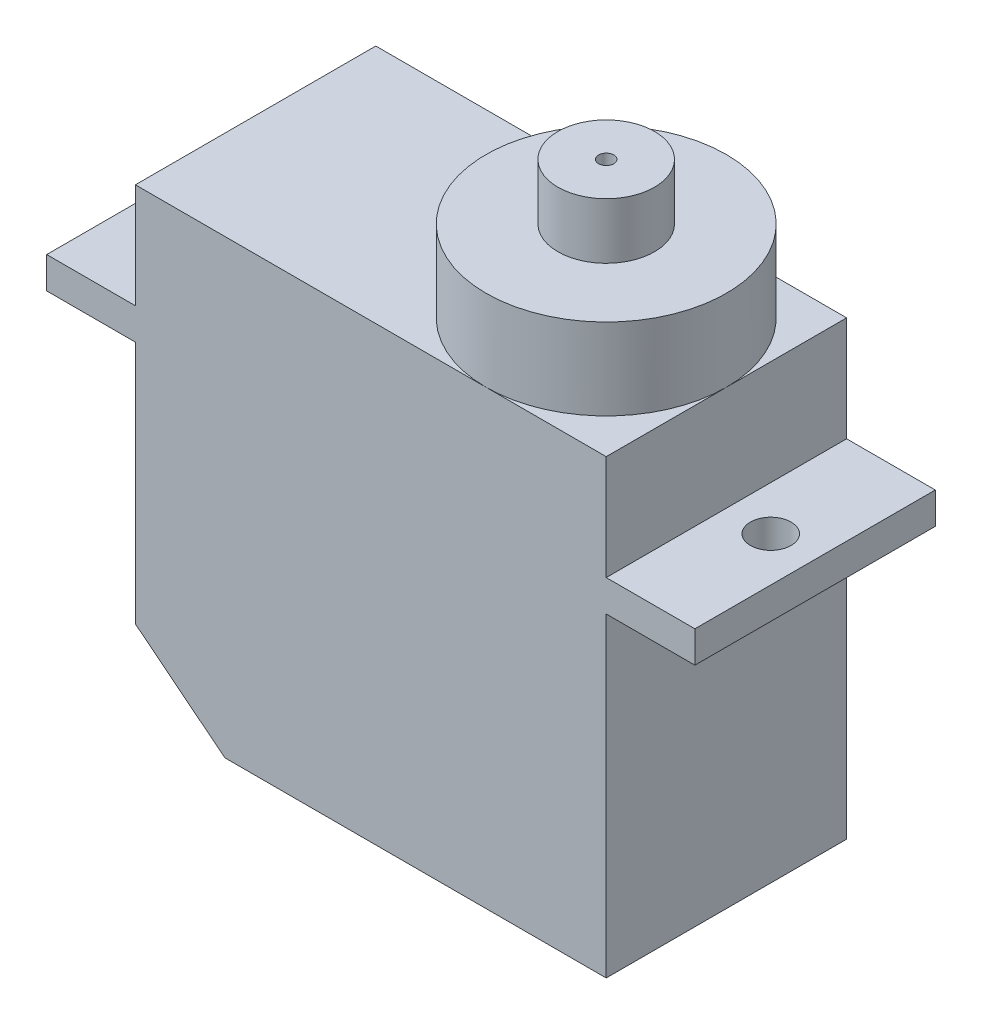
ISO-10303-21;
HEADER;
FILE_DESCRIPTION(('STEP AP214'),'2;1');
FILE_NAME('part.step','',(''),(''),'','','');
FILE_SCHEMA(('AUTOMOTIVE_DESIGN { 1 0 10303 214 1 1 1 1 }'));
ENDSEC;
DATA;
#1=APPLICATION_CONTEXT('core data for automotive mechanical design processes');
#2=APPLICATION_PROTOCOL_DEFINITION('international standard','automotive_design',2000,#1);
#3=PRODUCT_CONTEXT('',#1,'mechanical');
#4=PRODUCT('Part','Part','',(#3));
#5=PRODUCT_RELATED_PRODUCT_CATEGORY('part','',(#4));
#6=PRODUCT_DEFINITION_FORMATION('','',#4);
#7=PRODUCT_DEFINITION_CONTEXT('part definition',#1,'design');
#8=PRODUCT_DEFINITION('design','',#6,#7);
#9=PRODUCT_DEFINITION_SHAPE('','',#8);
#10=(LENGTH_UNIT() NAMED_UNIT(*) SI_UNIT(.MILLI.,.METRE.));
#11=(NAMED_UNIT(*) PLANE_ANGLE_UNIT() SI_UNIT($,.RADIAN.));
#12=(NAMED_UNIT(*) SI_UNIT($,.STERADIAN.) SOLID_ANGLE_UNIT());
#13=UNCERTAINTY_MEASURE_WITH_UNIT(LENGTH_MEASURE(1.E-05),#10,'distance_accuracy_value','');
#14=(GEOMETRIC_REPRESENTATION_CONTEXT(3) GLOBAL_UNCERTAINTY_ASSIGNED_CONTEXT((#13)) GLOBAL_UNIT_ASSIGNED_CONTEXT((#10,
#11,#12)) REPRESENTATION_CONTEXT('',''));
#15=CARTESIAN_POINT('',(0.,0.,0.));
#16=DIRECTION('',(0.,0.,1.));
#17=DIRECTION('',(1.,0.,0.));
#18=AXIS2_PLACEMENT_3D('',#15,#16,#17);
#19=CARTESIAN_POINT('',(17.24,26.2,-5.91));
#20=DIRECTION('',(0.,1.,0.));
#21=DIRECTION('',(0.,0.,1.));
#22=AXIS2_PLACEMENT_3D('',#19,#20,#21);
#23=PLANE('',#22);
#24=CARTESIAN_POINT('',(17.24,26.2,-5.91));
#25=DIRECTION('',(0.,1.,0.));
#26=DIRECTION('',(0.,0.,1.));
#27=AXIS2_PLACEMENT_3D('',#24,#25,#26);
#28=CIRCLE('',#27,5.91);
#29=CARTESIAN_POINT('',(17.24,26.2,0.));
#30=VERTEX_POINT('',#29);
#31=EDGE_CURVE('E161',#30,#30,#28,.T.);
#32=ORIENTED_EDGE('',*,*,#31,.T.);
#33=EDGE_LOOP('',(#32));
#34=FACE_BOUND('',#33,.T.);
#35=CARTESIAN_POINT('',(17.24,26.2,-5.91));
#36=DIRECTION('',(0.,1.,0.));
#37=DIRECTION('',(0.,0.,1.));
#38=AXIS2_PLACEMENT_3D('',#35,#36,#37);
#39=CIRCLE('',#38,2.375);
#40=CARTESIAN_POINT('',(17.24,26.2,-3.535));
#41=VERTEX_POINT('',#40);
#42=EDGE_CURVE('E528',#41,#41,#39,.T.);
#43=ORIENTED_EDGE('',*,*,#42,.F.);
#44=EDGE_LOOP('',(#43));
#45=FACE_BOUND('',#44,.T.);
#46=ADVANCED_FACE('F33',(#34,#45),#23,.T.);
#47=CARTESIAN_POINT('',(0.,22.2,-11.82));
#48=DIRECTION('',(0.,-1.,0.));
#49=DIRECTION('',(0.,0.,-1.));
#50=AXIS2_PLACEMENT_3D('',#47,#48,#49);
#51=PLANE('',#50);
#52=CARTESIAN_POINT('',(17.24,22.2,-5.91));
#53=DIRECTION('',(0.,1.,0.));
#54=DIRECTION('',(0.,0.,1.));
#55=AXIS2_PLACEMENT_3D('',#52,#53,#54);
#56=CIRCLE('',#55,5.91);
#57=CARTESIAN_POINT('',(17.24,22.2,0.));
#58=VERTEX_POINT('',#57);
#59=CARTESIAN_POINT('',(23.15,22.2,-5.91));
#60=VERTEX_POINT('',#59);
#61=EDGE_CURVE('E44',#58,#60,#56,.T.);
#62=ORIENTED_EDGE('',*,*,#61,.F.);
#63=DIRECTION('',(1.,0.,0.));
#64=VECTOR('',#63,1.);
#65=CARTESIAN_POINT('',(0.,22.2,0.));
#66=LINE('',#65,#64);
#67=CARTESIAN_POINT('',(23.15,22.2,0.));
#68=VERTEX_POINT('',#67);
#69=EDGE_CURVE('E145',#58,#68,#66,.T.);
#70=ORIENTED_EDGE('',*,*,#69,.T.);
#71=DIRECTION('',(0.,0.,-1.));
#72=VECTOR('',#71,1.);
#73=CARTESIAN_POINT('',(23.15,22.2,0.));
#74=LINE('',#73,#72);
#75=EDGE_CURVE('E159',#68,#60,#74,.T.);
#76=ORIENTED_EDGE('',*,*,#75,.T.);
#77=EDGE_LOOP('',(#62,#70,#76));
#78=FACE_BOUND('',#77,.T.);
#79=ADVANCED_FACE('F158',(#78),#51,.F.);
#80=CARTESIAN_POINT('',(17.24,22.2,-11.82));
#81=VERTEX_POINT('',#80);
#82=EDGE_CURVE('E11',#60,#81,#56,.T.);
#83=ORIENTED_EDGE('',*,*,#82,.F.);
#84=CARTESIAN_POINT('',(23.15,22.2,-11.82));
#85=VERTEX_POINT('',#84);
#86=EDGE_CURVE('E144',#60,#85,#74,.T.);
#87=ORIENTED_EDGE('',*,*,#86,.T.);
#88=DIRECTION('',(-1.,0.,0.));
#89=VECTOR('',#88,1.);
#90=CARTESIAN_POINT('',(0.,22.2,-11.82));
#91=LINE('',#90,#89);
#92=EDGE_CURVE('E237',#85,#81,#91,.T.);
#93=ORIENTED_EDGE('',*,*,#92,.T.);
#94=EDGE_LOOP('',(#83,#87,#93));
#95=FACE_BOUND('',#94,.T.);
#96=ADVANCED_FACE('F289',(#95),#51,.F.);
#97=EDGE_CURVE('E42',#81,#58,#56,.T.);
#98=ORIENTED_EDGE('',*,*,#97,.F.);
#99=CARTESIAN_POINT('',(0.,22.2,-11.82));
#100=VERTEX_POINT('',#99);
#101=EDGE_CURVE('E236',#81,#100,#91,.T.);
#102=ORIENTED_EDGE('',*,*,#101,.T.);
#103=DIRECTION('',(0.,0.,1.));
#104=VECTOR('',#103,1.);
#105=CARTESIAN_POINT('',(0.,22.2,0.));
#106=LINE('',#105,#104);
#107=CARTESIAN_POINT('',(0.,22.2,0.));
#108=VERTEX_POINT('',#107);
#109=EDGE_CURVE('E140',#100,#108,#106,.T.);
#110=ORIENTED_EDGE('',*,*,#109,.T.);
#111=EDGE_CURVE('E136',#108,#58,#66,.T.);
#112=ORIENTED_EDGE('',*,*,#111,.T.);
#113=EDGE_LOOP('',(#98,#102,#110,#112));
#114=FACE_BOUND('',#113,.T.);
#115=ADVANCED_FACE('F138',(#114),#51,.F.);
#116=CARTESIAN_POINT('',(27.51,17.05,0.));
#117=DIRECTION('',(0.,-1.,0.));
#118=DIRECTION('',(0.,0.,-1.));
#119=AXIS2_PLACEMENT_3D('',#116,#117,#118);
#120=PLANE('',#119);
#121=DIRECTION('',(1.,0.,0.));
#122=VECTOR('',#121,1.);
#123=CARTESIAN_POINT('',(27.51,17.05,0.));
#124=LINE('',#123,#122);
#125=CARTESIAN_POINT('',(-4.36,17.05,0.));
#126=VERTEX_POINT('',#125);
#127=CARTESIAN_POINT('',(0.,17.05,0.));
#128=VERTEX_POINT('',#127);
#129=EDGE_CURVE('E196',#126,#128,#124,.T.);
#130=ORIENTED_EDGE('',*,*,#129,.T.);
#131=DIRECTION('',(0.,0.,-1.));
#132=VECTOR('',#131,1.);
#133=CARTESIAN_POINT('',(0.,17.05,0.));
#134=LINE('',#133,#132);
#135=CARTESIAN_POINT('',(0.,17.05,-11.82));
#136=VERTEX_POINT('',#135);
#137=EDGE_CURVE('E230',#128,#136,#134,.T.);
#138=ORIENTED_EDGE('',*,*,#137,.T.);
#139=DIRECTION('',(-1.,0.,0.));
#140=VECTOR('',#139,1.);
#141=CARTESIAN_POINT('',(27.51,17.05,-11.82));
#142=LINE('',#141,#140);
#143=CARTESIAN_POINT('',(-4.36,17.05,-11.82));
#144=VERTEX_POINT('',#143);
#145=EDGE_CURVE('E189',#136,#144,#142,.T.);
#146=ORIENTED_EDGE('',*,*,#145,.T.);
#147=DIRECTION('',(0.,0.,1.));
#148=VECTOR('',#147,1.);
#149=CARTESIAN_POINT('',(-4.36,17.05,-11.82));
#150=LINE('',#149,#148);
#151=EDGE_CURVE('E193',#144,#126,#150,.T.);
#152=ORIENTED_EDGE('',*,*,#151,.T.);
#153=EDGE_LOOP('',(#130,#138,#146,#152));
#154=FACE_BOUND('',#153,.T.);
#155=CARTESIAN_POINT('',(-2.18,17.05,-5.91));
#156=DIRECTION('',(0.,-1.,0.));
#157=DIRECTION('',(0.,0.,-1.));
#158=AXIS2_PLACEMENT_3D('',#155,#156,#157);
#159=CIRCLE('',#158,1.);
#160=CARTESIAN_POINT('',(-2.18,17.05,-6.91));
#161=VERTEX_POINT('',#160);
#162=EDGE_CURVE('E179',#161,#161,#159,.F.);
#163=ORIENTED_EDGE('',*,*,#162,.F.);
#164=EDGE_LOOP('',(#163));
#165=FACE_BOUND('',#164,.T.);
#166=ADVANCED_FACE('F267',(#154,#165),#120,.F.);
#167=CARTESIAN_POINT('',(27.51,15.5,0.));
#168=DIRECTION('',(0.,-1.,0.));
#169=DIRECTION('',(0.,0.,-1.));
#170=AXIS2_PLACEMENT_3D('',#167,#168,#169);
#171=PLANE('',#170);
#172=DIRECTION('',(0.,0.,-1.));
#173=VECTOR('',#172,1.);
#174=CARTESIAN_POINT('',(0.,15.5,0.));
#175=LINE('',#174,#173);
#176=CARTESIAN_POINT('',(0.,15.5,0.));
#177=VERTEX_POINT('',#176);
#178=CARTESIAN_POINT('',(0.,15.5,-11.82));
#179=VERTEX_POINT('',#178);
#180=EDGE_CURVE('E225',#177,#179,#175,.T.);
#181=ORIENTED_EDGE('',*,*,#180,.F.);
#182=DIRECTION('',(1.,0.,0.));
#183=VECTOR('',#182,1.);
#184=CARTESIAN_POINT('',(27.51,15.5,0.));
#185=LINE('',#184,#183);
#186=CARTESIAN_POINT('',(-4.36,15.5,0.));
#187=VERTEX_POINT('',#186);
#188=EDGE_CURVE('E190',#187,#177,#185,.T.);
#189=ORIENTED_EDGE('',*,*,#188,.F.);
#190=DIRECTION('',(0.,0.,1.));
#191=VECTOR('',#190,1.);
#192=CARTESIAN_POINT('',(-4.36,15.5,-11.82));
#193=LINE('',#192,#191);
#194=CARTESIAN_POINT('',(-4.36,15.5,-11.82));
#195=VERTEX_POINT('',#194);
#196=EDGE_CURVE('E206',#195,#187,#193,.T.);
#197=ORIENTED_EDGE('',*,*,#196,.F.);
#198=DIRECTION('',(-1.,0.,0.));
#199=VECTOR('',#198,1.);
#200=CARTESIAN_POINT('',(27.51,15.5,-11.82));
#201=LINE('',#200,#199);
#202=EDGE_CURVE('E202',#179,#195,#201,.T.);
#203=ORIENTED_EDGE('',*,*,#202,.F.);
#204=EDGE_LOOP('',(#181,#189,#197,#203));
#205=FACE_BOUND('',#204,.T.);
#206=CARTESIAN_POINT('',(-2.18,15.5,-5.91));
#207=DIRECTION('',(0.,1.,0.));
#208=DIRECTION('',(0.,0.,1.));
#209=AXIS2_PLACEMENT_3D('',#206,#207,#208);
#210=CIRCLE('',#209,1.);
#211=CARTESIAN_POINT('',(-2.18,15.5,-4.91));
#212=VERTEX_POINT('',#211);
#213=EDGE_CURVE('E176',#212,#212,#210,.T.);
#214=ORIENTED_EDGE('',*,*,#213,.T.);
#215=EDGE_LOOP('',(#214));
#216=FACE_BOUND('',#215,.T.);
#217=ADVANCED_FACE('F275',(#205,#216),#171,.T.);
#218=DIRECTION('',(0.,0.,1.));
#219=VECTOR('',#218,1.);
#220=CARTESIAN_POINT('',(23.15,15.5,0.));
#221=LINE('',#220,#219);
#222=CARTESIAN_POINT('',(23.15,15.5,-11.82));
#223=VERTEX_POINT('',#222);
#224=CARTESIAN_POINT('',(23.15,15.5,0.));
#225=VERTEX_POINT('',#224);
#226=EDGE_CURVE('E222',#223,#225,#221,.T.);
#227=ORIENTED_EDGE('',*,*,#226,.F.);
#228=CARTESIAN_POINT('',(27.51,15.5,-11.82));
#229=VERTEX_POINT('',#228);
#230=EDGE_CURVE('E203',#229,#223,#201,.T.);
#231=ORIENTED_EDGE('',*,*,#230,.F.);
#232=DIRECTION('',(0.,0.,-1.));
#233=VECTOR('',#232,1.);
#234=CARTESIAN_POINT('',(27.51,15.5,-11.82));
#235=LINE('',#234,#233);
#236=CARTESIAN_POINT('',(27.51,15.5,0.));
#237=VERTEX_POINT('',#236);
#238=EDGE_CURVE('E199',#237,#229,#235,.T.);
#239=ORIENTED_EDGE('',*,*,#238,.F.);
#240=EDGE_CURVE('E208',#225,#237,#185,.T.);
#241=ORIENTED_EDGE('',*,*,#240,.F.);
#242=EDGE_LOOP('',(#227,#231,#239,#241));
#243=FACE_BOUND('',#242,.T.);
#244=CARTESIAN_POINT('',(25.33,15.5,-5.91));
#245=DIRECTION('',(0.,1.,0.));
#246=DIRECTION('',(0.,0.,1.));
#247=AXIS2_PLACEMENT_3D('',#244,#245,#246);
#248=CIRCLE('',#247,1.);
#249=CARTESIAN_POINT('',(25.33,15.5,-4.91));
#250=VERTEX_POINT('',#249);
#251=EDGE_CURVE('E182',#250,#250,#248,.T.);
#252=ORIENTED_EDGE('',*,*,#251,.T.);
#253=EDGE_LOOP('',(#252));
#254=FACE_BOUND('',#253,.T.);
#255=ADVANCED_FACE('F264',(#243,#254),#171,.T.);
#256=CARTESIAN_POINT('',(27.51,17.05,-11.82));
#257=VERTEX_POINT('',#256);
#258=CARTESIAN_POINT('',(23.15,17.05,-11.82));
#259=VERTEX_POINT('',#258);
#260=EDGE_CURVE('E191',#257,#259,#142,.T.);
#261=ORIENTED_EDGE('',*,*,#260,.T.);
#262=DIRECTION('',(0.,0.,1.));
#263=VECTOR('',#262,1.);
#264=CARTESIAN_POINT('',(23.15,17.05,0.));
#265=LINE('',#264,#263);
#266=CARTESIAN_POINT('',(23.15,17.05,0.));
#267=VERTEX_POINT('',#266);
#268=EDGE_CURVE('E228',#259,#267,#265,.T.);
#269=ORIENTED_EDGE('',*,*,#268,.T.);
#270=CARTESIAN_POINT('',(27.51,17.05,0.));
#271=VERTEX_POINT('',#270);
#272=EDGE_CURVE('E195',#267,#271,#124,.T.);
#273=ORIENTED_EDGE('',*,*,#272,.T.);
#274=DIRECTION('',(0.,0.,-1.));
#275=VECTOR('',#274,1.);
#276=CARTESIAN_POINT('',(27.51,17.05,-11.82));
#277=LINE('',#276,#275);
#278=EDGE_CURVE('E186',#271,#257,#277,.T.);
#279=ORIENTED_EDGE('',*,*,#278,.T.);
#280=EDGE_LOOP('',(#261,#269,#273,#279));
#281=FACE_BOUND('',#280,.T.);
#282=CARTESIAN_POINT('',(25.33,17.05,-5.91));
#283=DIRECTION('',(0.,-1.,0.));
#284=DIRECTION('',(0.,0.,-1.));
#285=AXIS2_PLACEMENT_3D('',#282,#283,#284);
#286=CIRCLE('',#285,1.);
#287=CARTESIAN_POINT('',(25.33,17.05,-6.91));
#288=VERTEX_POINT('',#287);
#289=EDGE_CURVE('E185',#288,#288,#286,.F.);
#290=ORIENTED_EDGE('',*,*,#289,.F.);
#291=EDGE_LOOP('',(#290));
#292=FACE_BOUND('',#291,.T.);
#293=ADVANCED_FACE('F261',(#281,#292),#120,.F.);
#294=CARTESIAN_POINT('',(0.,22.2,0.));
#295=DIRECTION('',(1.,0.,0.));
#296=DIRECTION('',(0.,0.,-1.));
#297=AXIS2_PLACEMENT_3D('',#294,#295,#296);
#298=PLANE('',#297);
#299=ORIENTED_EDGE('',*,*,#137,.F.);
#300=DIRECTION('',(0.,-1.,0.));
#301=VECTOR('',#300,1.);
#302=CARTESIAN_POINT('',(0.,22.2,0.));
#303=LINE('',#302,#301);
#304=EDGE_CURVE('E164',#108,#128,#303,.T.);
#305=ORIENTED_EDGE('',*,*,#304,.F.);
#306=ORIENTED_EDGE('',*,*,#109,.F.);
#307=DIRECTION('',(0.,-1.,0.));
#308=VECTOR('',#307,1.);
#309=CARTESIAN_POINT('',(0.,22.2,-11.82));
#310=LINE('',#309,#308);
#311=EDGE_CURVE('E246',#100,#136,#310,.T.);
#312=ORIENTED_EDGE('',*,*,#311,.T.);
#313=EDGE_LOOP('',(#299,#305,#306,#312));
#314=FACE_BOUND('',#313,.T.);
#315=ADVANCED_FACE('F263',(#314),#298,.F.);
#316=CARTESIAN_POINT('',(23.15,22.2,0.));
#317=DIRECTION('',(-1.,0.,0.));
#318=DIRECTION('',(0.,0.,1.));
#319=AXIS2_PLACEMENT_3D('',#316,#317,#318);
#320=PLANE('',#319);
#321=ORIENTED_EDGE('',*,*,#268,.F.);
#322=DIRECTION('',(0.,-1.,0.));
#323=VECTOR('',#322,1.);
#324=CARTESIAN_POINT('',(23.15,22.2,-11.82));
#325=LINE('',#324,#323);
#326=EDGE_CURVE('E250',#85,#259,#325,.T.);
#327=ORIENTED_EDGE('',*,*,#326,.F.);
#328=ORIENTED_EDGE('',*,*,#86,.F.);
#329=ORIENTED_EDGE('',*,*,#75,.F.);
#330=DIRECTION('',(0.,-1.,0.));
#331=VECTOR('',#330,1.);
#332=CARTESIAN_POINT('',(23.15,22.2,0.));
#333=LINE('',#332,#331);
#334=EDGE_CURVE('E153',#68,#267,#333,.T.);
#335=ORIENTED_EDGE('',*,*,#334,.T.);
#336=EDGE_LOOP('',(#321,#327,#328,#329,#335));
#337=FACE_BOUND('',#336,.T.);
#338=ADVANCED_FACE('F273',(#337),#320,.F.);
#339=CARTESIAN_POINT('',(0.,3.5,-11.82));
#340=VERTEX_POINT('',#339);
#341=EDGE_CURVE('E239',#179,#340,#310,.T.);
#342=ORIENTED_EDGE('',*,*,#341,.T.);
#343=DIRECTION('',(0.,0.,1.));
#344=VECTOR('',#343,1.);
#345=CARTESIAN_POINT('',(0.,3.5,0.));
#346=LINE('',#345,#344);
#347=CARTESIAN_POINT('',(0.,3.5,0.));
#348=VERTEX_POINT('',#347);
#349=EDGE_CURVE('E171',#340,#348,#346,.T.);
#350=ORIENTED_EDGE('',*,*,#349,.T.);
#351=EDGE_CURVE('E255',#177,#348,#303,.T.);
#352=ORIENTED_EDGE('',*,*,#351,.F.);
#353=ORIENTED_EDGE('',*,*,#180,.T.);
#354=EDGE_LOOP('',(#342,#350,#352,#353));
#355=FACE_BOUND('',#354,.T.);
#356=ADVANCED_FACE('F35',(#355),#298,.F.);
#357=CARTESIAN_POINT('',(0.,22.2,0.));
#358=DIRECTION('',(0.,0.,-1.));
#359=DIRECTION('',(-1.,0.,0.));
#360=AXIS2_PLACEMENT_3D('',#357,#358,#359);
#361=PLANE('',#360);
#362=ORIENTED_EDGE('',*,*,#351,.T.);
#363=DIRECTION('',(-0.782601054175649,0.622523565821538,0.));
#364=VECTOR('',#363,1.);
#365=CARTESIAN_POINT('',(-3.07564492145405,5.94653573297481,0.));
#366=LINE('',#365,#364);
#367=CARTESIAN_POINT('',(4.4,0.,0.));
#368=VERTEX_POINT('',#367);
#369=EDGE_CURVE('E172',#368,#348,#366,.T.);
#370=ORIENTED_EDGE('',*,*,#369,.F.);
#371=DIRECTION('',(1.,0.,0.));
#372=VECTOR('',#371,1.);
#373=CARTESIAN_POINT('',(0.,0.,0.));
#374=LINE('',#373,#372);
#375=CARTESIAN_POINT('',(23.15,0.,0.));
#376=VERTEX_POINT('',#375);
#377=EDGE_CURVE('E232',#368,#376,#374,.T.);
#378=ORIENTED_EDGE('',*,*,#377,.T.);
#379=EDGE_CURVE('E253',#225,#376,#333,.T.);
#380=ORIENTED_EDGE('',*,*,#379,.F.);
#381=ORIENTED_EDGE('',*,*,#240,.T.);
#382=DIRECTION('',(0.,-1.,0.));
#383=VECTOR('',#382,1.);
#384=CARTESIAN_POINT('',(27.51,17.05,0.));
#385=LINE('',#384,#383);
#386=EDGE_CURVE('E198',#271,#237,#385,.T.);
#387=ORIENTED_EDGE('',*,*,#386,.F.);
#388=ORIENTED_EDGE('',*,*,#272,.F.);
#389=ORIENTED_EDGE('',*,*,#334,.F.);
#390=ORIENTED_EDGE('',*,*,#69,.F.);
#391=ORIENTED_EDGE('',*,*,#111,.F.);
#392=ORIENTED_EDGE('',*,*,#304,.T.);
#393=ORIENTED_EDGE('',*,*,#129,.F.);
#394=DIRECTION('',(0.,-1.,0.));
#395=VECTOR('',#394,1.);
#396=CARTESIAN_POINT('',(-4.36,17.05,0.));
#397=LINE('',#396,#395);
#398=EDGE_CURVE('E213',#126,#187,#397,.T.);
#399=ORIENTED_EDGE('',*,*,#398,.T.);
#400=ORIENTED_EDGE('',*,*,#188,.T.);
#401=EDGE_LOOP('',(#362,#370,#378,#380,#381,#387,#388,#389,#390,#391,#392,#393,#399,#400));
#402=FACE_BOUND('',#401,.T.);
#403=ADVANCED_FACE('F150',(#402),#361,.F.);
#404=CARTESIAN_POINT('',(23.15,0.,-11.82));
#405=VERTEX_POINT('',#404);
#406=EDGE_CURVE('E249',#223,#405,#325,.T.);
#407=ORIENTED_EDGE('',*,*,#406,.F.);
#408=ORIENTED_EDGE('',*,*,#226,.T.);
#409=ORIENTED_EDGE('',*,*,#379,.T.);
#410=DIRECTION('',(0.,0.,-1.));
#411=VECTOR('',#410,1.);
#412=CARTESIAN_POINT('',(23.15,0.,0.));
#413=LINE('',#412,#411);
#414=EDGE_CURVE('E241',#376,#405,#413,.T.);
#415=ORIENTED_EDGE('',*,*,#414,.T.);
#416=EDGE_LOOP('',(#407,#408,#409,#415));
#417=FACE_BOUND('',#416,.T.);
#418=ADVANCED_FACE('F330',(#417),#320,.F.);
#419=CARTESIAN_POINT('',(0.,22.2,-11.82));
#420=DIRECTION('',(0.,0.,1.));
#421=DIRECTION('',(1.,0.,0.));
#422=AXIS2_PLACEMENT_3D('',#419,#420,#421);
#423=PLANE('',#422);
#424=DIRECTION('',(-1.,0.,0.));
#425=VECTOR('',#424,1.);
#426=CARTESIAN_POINT('',(0.,0.,-11.82));
#427=LINE('',#426,#425);
#428=CARTESIAN_POINT('',(4.4,0.,-11.82));
#429=VERTEX_POINT('',#428);
#430=EDGE_CURVE('E233',#405,#429,#427,.T.);
#431=ORIENTED_EDGE('',*,*,#430,.T.);
#432=DIRECTION('',(-0.782601054175649,0.622523565821538,0.));
#433=VECTOR('',#432,1.);
#434=CARTESIAN_POINT('',(-3.07564492145405,5.94653573297481,-11.82));
#435=LINE('',#434,#433);
#436=EDGE_CURVE('E168',#429,#340,#435,.T.);
#437=ORIENTED_EDGE('',*,*,#436,.T.);
#438=ORIENTED_EDGE('',*,*,#341,.F.);
#439=ORIENTED_EDGE('',*,*,#202,.T.);
#440=DIRECTION('',(0.,-1.,0.));
#441=VECTOR('',#440,1.);
#442=CARTESIAN_POINT('',(-4.36,17.05,-11.82));
#443=LINE('',#442,#441);
#444=EDGE_CURVE('E216',#144,#195,#443,.T.);
#445=ORIENTED_EDGE('',*,*,#444,.F.);
#446=ORIENTED_EDGE('',*,*,#145,.F.);
#447=ORIENTED_EDGE('',*,*,#311,.F.);
#448=ORIENTED_EDGE('',*,*,#101,.F.);
#449=ORIENTED_EDGE('',*,*,#92,.F.);
#450=ORIENTED_EDGE('',*,*,#326,.T.);
#451=ORIENTED_EDGE('',*,*,#260,.F.);
#452=DIRECTION('',(0.,-1.,0.));
#453=VECTOR('',#452,1.);
#454=CARTESIAN_POINT('',(27.51,17.05,-11.82));
#455=LINE('',#454,#453);
#456=EDGE_CURVE('E219',#257,#229,#455,.T.);
#457=ORIENTED_EDGE('',*,*,#456,.T.);
#458=ORIENTED_EDGE('',*,*,#230,.T.);
#459=ORIENTED_EDGE('',*,*,#406,.T.);
#460=EDGE_LOOP('',(#431,#437,#438,#439,#445,#446,#447,#448,#449,#450,#451,#457,#458,#459));
#461=FACE_BOUND('',#460,.T.);
#462=ADVANCED_FACE('F326',(#461),#423,.F.);
#463=CARTESIAN_POINT('',(0.,0.,-11.82));
#464=DIRECTION('',(0.,-1.,0.));
#465=DIRECTION('',(0.,0.,-1.));
#466=AXIS2_PLACEMENT_3D('',#463,#464,#465);
#467=PLANE('',#466);
#468=DIRECTION('',(0.,0.,1.));
#469=VECTOR('',#468,1.);
#470=CARTESIAN_POINT('',(4.4,0.,-11.82));
#471=LINE('',#470,#469);
#472=EDGE_CURVE('E37',#429,#368,#471,.T.);
#473=ORIENTED_EDGE('',*,*,#472,.F.);
#474=ORIENTED_EDGE('',*,*,#430,.F.);
#475=ORIENTED_EDGE('',*,*,#414,.F.);
#476=ORIENTED_EDGE('',*,*,#377,.F.);
#477=EDGE_LOOP('',(#473,#474,#475,#476));
#478=FACE_BOUND('',#477,.T.);
#479=ADVANCED_FACE('F320',(#478),#467,.T.);
#480=CARTESIAN_POINT('',(27.51,17.05,-11.82));
#481=DIRECTION('',(-1.,0.,0.));
#482=DIRECTION('',(0.,0.,1.));
#483=AXIS2_PLACEMENT_3D('',#480,#481,#482);
#484=PLANE('',#483);
#485=ORIENTED_EDGE('',*,*,#238,.T.);
#486=ORIENTED_EDGE('',*,*,#456,.F.);
#487=ORIENTED_EDGE('',*,*,#278,.F.);
#488=ORIENTED_EDGE('',*,*,#386,.T.);
#489=EDGE_LOOP('',(#485,#486,#487,#488));
#490=FACE_BOUND('',#489,.T.);
#491=ADVANCED_FACE('F311',(#490),#484,.F.);
#492=CARTESIAN_POINT('',(-4.36,17.05,-11.82));
#493=DIRECTION('',(1.,0.,0.));
#494=DIRECTION('',(0.,0.,-1.));
#495=AXIS2_PLACEMENT_3D('',#492,#493,#494);
#496=PLANE('',#495);
#497=ORIENTED_EDGE('',*,*,#196,.T.);
#498=ORIENTED_EDGE('',*,*,#398,.F.);
#499=ORIENTED_EDGE('',*,*,#151,.F.);
#500=ORIENTED_EDGE('',*,*,#444,.T.);
#501=EDGE_LOOP('',(#497,#498,#499,#500));
#502=FACE_BOUND('',#501,.T.);
#503=ADVANCED_FACE('F307',(#502),#496,.F.);
#504=CARTESIAN_POINT('',(25.33,22.2,-5.91));
#505=DIRECTION('',(0.,-1.,0.));
#506=DIRECTION('',(0.,0.,-1.));
#507=AXIS2_PLACEMENT_3D('',#504,#505,#506);
#508=CYLINDRICAL_SURFACE('',#507,1.);
#509=ORIENTED_EDGE('',*,*,#251,.F.);
#510=EDGE_LOOP('',(#509));
#511=FACE_BOUND('',#510,.T.);
#512=ORIENTED_EDGE('',*,*,#289,.T.);
#513=EDGE_LOOP('',(#512));
#514=FACE_BOUND('',#513,.T.);
#515=ADVANCED_FACE('F259',(#511,#514),#508,.F.);
#516=CARTESIAN_POINT('',(-2.18,22.2,-5.91));
#517=DIRECTION('',(0.,-1.,0.));
#518=DIRECTION('',(0.,0.,-1.));
#519=AXIS2_PLACEMENT_3D('',#516,#517,#518);
#520=CYLINDRICAL_SURFACE('',#519,1.);
#521=ORIENTED_EDGE('',*,*,#213,.F.);
#522=EDGE_LOOP('',(#521));
#523=FACE_BOUND('',#522,.T.);
#524=ORIENTED_EDGE('',*,*,#162,.T.);
#525=EDGE_LOOP('',(#524));
#526=FACE_BOUND('',#525,.T.);
#527=ADVANCED_FACE('F303',(#523,#526),#520,.F.);
#528=CARTESIAN_POINT('',(-3.07564492145405,5.94653573297481,-11.82));
#529=DIRECTION('',(0.622523565821538,0.782601054175649,0.));
#530=DIRECTION('',(-0.782601054175649,0.622523565821538,0.));
#531=AXIS2_PLACEMENT_3D('',#528,#529,#530);
#532=PLANE('',#531);
#533=ORIENTED_EDGE('',*,*,#436,.F.);
#534=ORIENTED_EDGE('',*,*,#472,.T.);
#535=ORIENTED_EDGE('',*,*,#369,.T.);
#536=ORIENTED_EDGE('',*,*,#349,.F.);
#537=EDGE_LOOP('',(#533,#534,#535,#536));
#538=FACE_BOUND('',#537,.T.);
#539=ADVANCED_FACE('F299',(#538),#532,.F.);
#540=CARTESIAN_POINT('',(17.24,26.2,-5.91));
#541=DIRECTION('',(0.,-1.,0.));
#542=DIRECTION('',(0.,0.,-1.));
#543=AXIS2_PLACEMENT_3D('',#540,#541,#542);
#544=CYLINDRICAL_SURFACE('',#543,5.91);
#545=ORIENTED_EDGE('',*,*,#31,.F.);
#546=EDGE_LOOP('',(#545));
#547=FACE_BOUND('',#546,.T.);
#548=ORIENTED_EDGE('',*,*,#61,.T.);
#549=ORIENTED_EDGE('',*,*,#82,.T.);
#550=ORIENTED_EDGE('',*,*,#97,.T.);
#551=EDGE_LOOP('',(#548,#549,#550));
#552=FACE_BOUND('',#551,.T.);
#553=ADVANCED_FACE('F163',(#547,#552),#544,.T.);
#554=CARTESIAN_POINT('',(17.24,28.95,-5.91));
#555=DIRECTION('',(0.,-1.,0.));
#556=DIRECTION('',(0.,0.,-1.));
#557=AXIS2_PLACEMENT_3D('',#554,#555,#556);
#558=CYLINDRICAL_SURFACE('',#557,2.375);
#559=CARTESIAN_POINT('',(17.24,28.95,-5.91));
#560=DIRECTION('',(0.,1.,0.));
#561=DIRECTION('',(0.,0.,1.));
#562=AXIS2_PLACEMENT_3D('',#559,#560,#561);
#563=CIRCLE('',#562,2.375);
#564=CARTESIAN_POINT('',(17.24,28.95,-3.535));
#565=VERTEX_POINT('',#564);
#566=EDGE_CURVE('E162',#565,#565,#563,.T.);
#567=ORIENTED_EDGE('',*,*,#566,.F.);
#568=EDGE_LOOP('',(#567));
#569=FACE_BOUND('',#568,.T.);
#570=ORIENTED_EDGE('',*,*,#42,.T.);
#571=EDGE_LOOP('',(#570));
#572=FACE_BOUND('',#571,.T.);
#573=ADVANCED_FACE('F295',(#569,#572),#558,.T.);
#574=CARTESIAN_POINT('',(17.24,28.95,-5.91));
#575=DIRECTION('',(0.,1.,0.));
#576=DIRECTION('',(0.,0.,1.));
#577=AXIS2_PLACEMENT_3D('',#574,#575,#576);
#578=PLANE('',#577);
#579=CARTESIAN_POINT('',(17.24,28.95,-5.91));
#580=DIRECTION('',(0.,1.,0.));
#581=DIRECTION('',(0.,0.,1.));
#582=AXIS2_PLACEMENT_3D('',#579,#580,#581);
#583=CIRCLE('',#582,0.374999999999999);
#584=CARTESIAN_POINT('',(17.24,28.95,-5.535));
#585=VERTEX_POINT('',#584);
#586=EDGE_CURVE('E529',#585,#585,#583,.T.);
#587=ORIENTED_EDGE('',*,*,#586,.F.);
#588=EDGE_LOOP('',(#587));
#589=FACE_BOUND('',#588,.T.);
#590=ORIENTED_EDGE('',*,*,#566,.T.);
#591=EDGE_LOOP('',(#590));
#592=FACE_BOUND('',#591,.T.);
#593=ADVANCED_FACE('F493',(#589,#592),#578,.T.);
#594=CARTESIAN_POINT('',(17.24,26.2,-5.91));
#595=DIRECTION('',(0.,1.,0.));
#596=DIRECTION('',(0.,0.,1.));
#597=AXIS2_PLACEMENT_3D('',#594,#595,#596);
#598=CYLINDRICAL_SURFACE('',#597,0.374999999999999);
#599=CARTESIAN_POINT('',(17.24,26.2,-5.91));
#600=DIRECTION('',(0.,1.,0.));
#601=DIRECTION('',(0.,0.,1.));
#602=AXIS2_PLACEMENT_3D('',#599,#600,#601);
#603=CIRCLE('',#602,0.374999999999999);
#604=CARTESIAN_POINT('',(17.24,26.2,-5.535));
#605=VERTEX_POINT('',#604);
#606=EDGE_CURVE('E527',#605,#605,#603,.T.);
#607=ORIENTED_EDGE('',*,*,#606,.F.);
#608=EDGE_LOOP('',(#607));
#609=FACE_BOUND('',#608,.T.);
#610=ORIENTED_EDGE('',*,*,#586,.T.);
#611=EDGE_LOOP('',(#610));
#612=FACE_BOUND('',#611,.T.);
#613=ADVANCED_FACE('F501',(#609,#612),#598,.F.);
#614=CARTESIAN_POINT('',(17.24,26.2,-5.91));
#615=DIRECTION('',(0.,1.,0.));
#616=DIRECTION('',(0.,0.,1.));
#617=AXIS2_PLACEMENT_3D('',#614,#615,#616);
#618=PLANE('',#617);
#619=ORIENTED_EDGE('',*,*,#606,.T.);
#620=EDGE_LOOP('',(#619));
#621=FACE_BOUND('',#620,.T.);
#622=ADVANCED_FACE('F509',(#621),#618,.T.);
#623=CLOSED_SHELL('',(#46,#79,#96,#115,#166,#217,#255,#293,#315,#338,#356,#403,#418,#462,#479,
#491,#503,#515,#527,#539,#553,#573,#593,#613,#622));
#624=MANIFOLD_SOLID_BREP('B2',#623);
#625=ADVANCED_BREP_SHAPE_REPRESENTATION('',(#18,#624),#14);
#626=SHAPE_DEFINITION_REPRESENTATION(#9,#625);
ENDSEC;
END-ISO-10303-21;
